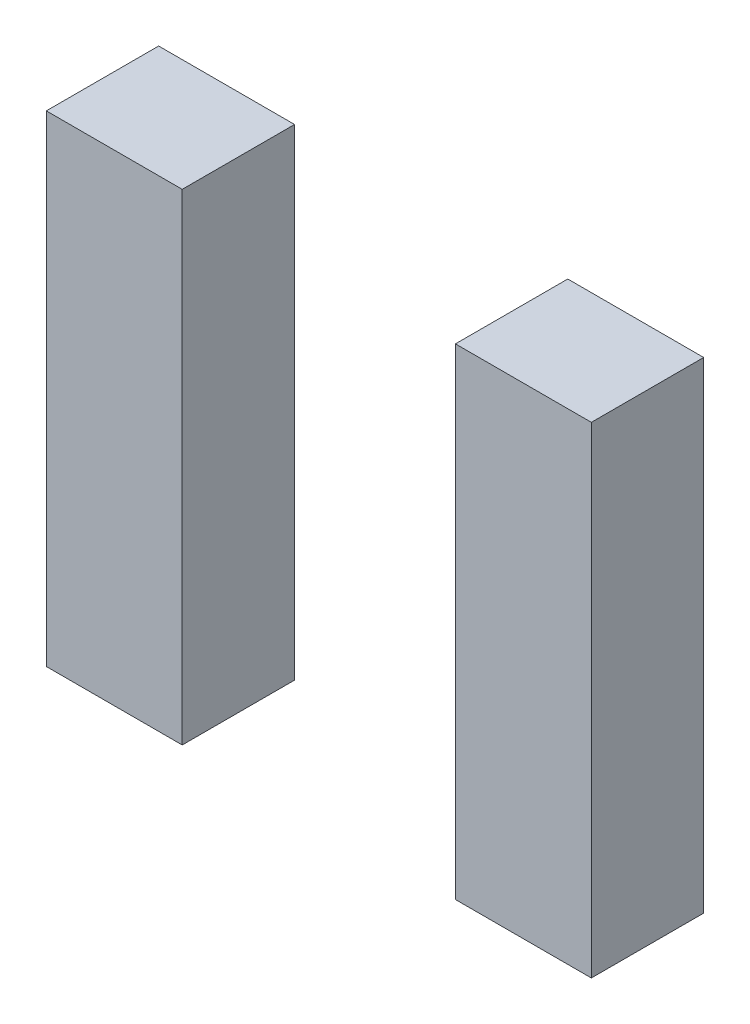
ISO-10303-21;
HEADER;
FILE_DESCRIPTION(('STEP AP214'),'2;1');
FILE_NAME('part.step','',(''),(''),'','','');
FILE_SCHEMA(('AUTOMOTIVE_DESIGN { 1 0 10303 214 1 1 1 1 }'));
ENDSEC;
DATA;
#1=APPLICATION_CONTEXT('core data for automotive mechanical design processes');
#2=APPLICATION_PROTOCOL_DEFINITION('international standard','automotive_design',2000,#1);
#3=PRODUCT_CONTEXT('',#1,'mechanical');
#4=PRODUCT('Part','Part','',(#3));
#5=PRODUCT_RELATED_PRODUCT_CATEGORY('part','',(#4));
#6=PRODUCT_DEFINITION_FORMATION('','',#4);
#7=PRODUCT_DEFINITION_CONTEXT('part definition',#1,'design');
#8=PRODUCT_DEFINITION('design','',#6,#7);
#9=PRODUCT_DEFINITION_SHAPE('','',#8);
#10=(LENGTH_UNIT() NAMED_UNIT(*) SI_UNIT(.MILLI.,.METRE.));
#11=(NAMED_UNIT(*) PLANE_ANGLE_UNIT() SI_UNIT($,.RADIAN.));
#12=(NAMED_UNIT(*) SI_UNIT($,.STERADIAN.) SOLID_ANGLE_UNIT());
#13=UNCERTAINTY_MEASURE_WITH_UNIT(LENGTH_MEASURE(1.E-05),#10,'distance_accuracy_value','');
#14=(GEOMETRIC_REPRESENTATION_CONTEXT(3) GLOBAL_UNCERTAINTY_ASSIGNED_CONTEXT((#13)) GLOBAL_UNIT_ASSIGNED_CONTEXT((#10,
#11,#12)) REPRESENTATION_CONTEXT('',''));
#15=CARTESIAN_POINT('',(0.,0.,0.));
#16=DIRECTION('',(0.,0.,1.));
#17=DIRECTION('',(1.,0.,0.));
#18=AXIS2_PLACEMENT_3D('',#15,#16,#17);
#19=CARTESIAN_POINT('',(-32.7279,44.069,20.574));
#20=DIRECTION('',(1.,0.,0.));
#21=DIRECTION('',(0.,1.,0.));
#22=AXIS2_PLACEMENT_3D('',#19,#20,#21);
#23=PLANE('',#22);
#24=DIRECTION('',(0.,-1.,0.));
#25=VECTOR('',#24,1.);
#26=CARTESIAN_POINT('',(-32.7279,44.069,0.));
#27=LINE('',#26,#25);
#28=CARTESIAN_POINT('',(-32.7279,44.069,0.));
#29=VERTEX_POINT('',#28);
#30=CARTESIAN_POINT('',(-32.7279,-44.069,0.));
#31=VERTEX_POINT('',#30);
#32=EDGE_CURVE('E114',#29,#31,#27,.T.);
#33=ORIENTED_EDGE('',*,*,#32,.T.);
#34=DIRECTION('',(0.,0.,-1.));
#35=VECTOR('',#34,1.);
#36=CARTESIAN_POINT('',(-32.7279,-44.069,20.574));
#37=LINE('',#36,#35);
#38=CARTESIAN_POINT('',(-32.7279,-44.069,20.574));
#39=VERTEX_POINT('',#38);
#40=EDGE_CURVE('E12',#39,#31,#37,.T.);
#41=ORIENTED_EDGE('',*,*,#40,.F.);
#42=DIRECTION('',(0.,-1.,0.));
#43=VECTOR('',#42,1.);
#44=CARTESIAN_POINT('',(-32.7279,44.069,20.574));
#45=LINE('',#44,#43);
#46=CARTESIAN_POINT('',(-32.7279,44.069,20.574));
#47=VERTEX_POINT('',#46);
#48=EDGE_CURVE('E102',#47,#39,#45,.T.);
#49=ORIENTED_EDGE('',*,*,#48,.F.);
#50=DIRECTION('',(0.,0.,-1.));
#51=VECTOR('',#50,1.);
#52=CARTESIAN_POINT('',(-32.7279,44.069,20.574));
#53=LINE('',#52,#51);
#54=EDGE_CURVE('E110',#47,#29,#53,.T.);
#55=ORIENTED_EDGE('',*,*,#54,.T.);
#56=EDGE_LOOP('',(#33,#41,#49,#55));
#57=FACE_BOUND('',#56,.T.);
#58=ADVANCED_FACE('F51',(#57),#23,.F.);
#59=CARTESIAN_POINT('',(-32.7279,-44.069,20.574));
#60=DIRECTION('',(0.,1.,0.));
#61=DIRECTION('',(0.,0.,1.));
#62=AXIS2_PLACEMENT_3D('',#59,#60,#61);
#63=PLANE('',#62);
#64=DIRECTION('',(1.,0.,0.));
#65=VECTOR('',#64,1.);
#66=CARTESIAN_POINT('',(-32.7279,-44.069,0.));
#67=LINE('',#66,#65);
#68=CARTESIAN_POINT('',(-7.83590000000002,-44.069,0.));
#69=VERTEX_POINT('',#68);
#70=EDGE_CURVE('E106',#31,#69,#67,.T.);
#71=ORIENTED_EDGE('',*,*,#70,.T.);
#72=DIRECTION('',(0.,0.,-1.));
#73=VECTOR('',#72,1.);
#74=CARTESIAN_POINT('',(-7.83590000000002,-44.069,20.574));
#75=LINE('',#74,#73);
#76=CARTESIAN_POINT('',(-7.83590000000002,-44.069,20.574));
#77=VERTEX_POINT('',#76);
#78=EDGE_CURVE('E59',#77,#69,#75,.T.);
#79=ORIENTED_EDGE('',*,*,#78,.F.);
#80=DIRECTION('',(1.,0.,0.));
#81=VECTOR('',#80,1.);
#82=CARTESIAN_POINT('',(-32.7279,-44.069,20.574));
#83=LINE('',#82,#81);
#84=EDGE_CURVE('E97',#39,#77,#83,.T.);
#85=ORIENTED_EDGE('',*,*,#84,.F.);
#86=ORIENTED_EDGE('',*,*,#40,.T.);
#87=EDGE_LOOP('',(#71,#79,#85,#86));
#88=FACE_BOUND('',#87,.T.);
#89=ADVANCED_FACE('F105',(#88),#63,.F.);
#90=CARTESIAN_POINT('',(-7.83590000000003,44.069,20.574));
#91=DIRECTION('',(-1.,0.,0.));
#92=DIRECTION('',(0.,-1.,0.));
#93=AXIS2_PLACEMENT_3D('',#90,#91,#92);
#94=PLANE('',#93);
#95=DIRECTION('',(0.,1.,0.));
#96=VECTOR('',#95,1.);
#97=CARTESIAN_POINT('',(-7.83590000000003,44.069,0.));
#98=LINE('',#97,#96);
#99=CARTESIAN_POINT('',(-7.83590000000003,44.069,0.));
#100=VERTEX_POINT('',#99);
#101=EDGE_CURVE('E84',#69,#100,#98,.T.);
#102=ORIENTED_EDGE('',*,*,#101,.T.);
#103=DIRECTION('',(0.,0.,-1.));
#104=VECTOR('',#103,1.);
#105=CARTESIAN_POINT('',(-7.83590000000003,44.069,20.574));
#106=LINE('',#105,#104);
#107=CARTESIAN_POINT('',(-7.83590000000003,44.069,20.574));
#108=VERTEX_POINT('',#107);
#109=EDGE_CURVE('E107',#108,#100,#106,.T.);
#110=ORIENTED_EDGE('',*,*,#109,.F.);
#111=DIRECTION('',(0.,1.,0.));
#112=VECTOR('',#111,1.);
#113=CARTESIAN_POINT('',(-7.83590000000003,44.069,20.574));
#114=LINE('',#113,#112);
#115=EDGE_CURVE('E100',#77,#108,#114,.T.);
#116=ORIENTED_EDGE('',*,*,#115,.F.);
#117=ORIENTED_EDGE('',*,*,#78,.T.);
#118=EDGE_LOOP('',(#102,#110,#116,#117));
#119=FACE_BOUND('',#118,.T.);
#120=ADVANCED_FACE('F108',(#119),#94,.F.);
#121=CARTESIAN_POINT('',(-32.7279,44.069,20.574));
#122=DIRECTION('',(0.,-1.,0.));
#123=DIRECTION('',(0.,0.,-1.));
#124=AXIS2_PLACEMENT_3D('',#121,#122,#123);
#125=PLANE('',#124);
#126=DIRECTION('',(-1.,0.,0.));
#127=VECTOR('',#126,1.);
#128=CARTESIAN_POINT('',(-32.7279,44.069,0.));
#129=LINE('',#128,#127);
#130=EDGE_CURVE('E90',#100,#29,#129,.T.);
#131=ORIENTED_EDGE('',*,*,#130,.T.);
#132=ORIENTED_EDGE('',*,*,#54,.F.);
#133=DIRECTION('',(-1.,0.,0.));
#134=VECTOR('',#133,1.);
#135=CARTESIAN_POINT('',(-32.7279,44.069,20.574));
#136=LINE('',#135,#134);
#137=EDGE_CURVE('E67',#108,#47,#136,.T.);
#138=ORIENTED_EDGE('',*,*,#137,.F.);
#139=ORIENTED_EDGE('',*,*,#109,.T.);
#140=EDGE_LOOP('',(#131,#132,#138,#139));
#141=FACE_BOUND('',#140,.T.);
#142=ADVANCED_FACE('F121',(#141),#125,.F.);
#143=CARTESIAN_POINT('',(0.,0.,20.574));
#144=DIRECTION('',(0.,0.,1.));
#145=DIRECTION('',(1.,0.,0.));
#146=AXIS2_PLACEMENT_3D('',#143,#144,#145);
#147=PLANE('',#146);
#148=ORIENTED_EDGE('',*,*,#48,.T.);
#149=ORIENTED_EDGE('',*,*,#84,.T.);
#150=ORIENTED_EDGE('',*,*,#115,.T.);
#151=ORIENTED_EDGE('',*,*,#137,.T.);
#152=EDGE_LOOP('',(#148,#149,#150,#151));
#153=FACE_BOUND('',#152,.T.);
#154=ADVANCED_FACE('F98',(#153),#147,.T.);
#155=CARTESIAN_POINT('',(0.,0.,0.));
#156=DIRECTION('',(0.,0.,1.));
#157=DIRECTION('',(1.,0.,0.));
#158=AXIS2_PLACEMENT_3D('',#155,#156,#157);
#159=PLANE('',#158);
#160=ORIENTED_EDGE('',*,*,#32,.F.);
#161=ORIENTED_EDGE('',*,*,#130,.F.);
#162=ORIENTED_EDGE('',*,*,#101,.F.);
#163=ORIENTED_EDGE('',*,*,#70,.F.);
#164=EDGE_LOOP('',(#160,#161,#162,#163));
#165=FACE_BOUND('',#164,.T.);
#166=ADVANCED_FACE('F124',(#165),#159,.F.);
#167=CLOSED_SHELL('',(#58,#89,#120,#142,#154,#166));
#168=MANIFOLD_SOLID_BREP('B2',#167);
#169=CARTESIAN_POINT('',(-107.6579,43.561,20.574));
#170=DIRECTION('',(1.,0.,0.));
#171=DIRECTION('',(0.,0.,-1.));
#172=AXIS2_PLACEMENT_3D('',#169,#170,#171);
#173=PLANE('',#172);
#174=DIRECTION('',(0.,-1.,0.));
#175=VECTOR('',#174,1.);
#176=CARTESIAN_POINT('',(-107.6579,43.561,0.));
#177=LINE('',#176,#175);
#178=CARTESIAN_POINT('',(-107.6579,43.561,0.));
#179=VERTEX_POINT('',#178);
#180=CARTESIAN_POINT('',(-107.6579,-44.577,0.));
#181=VERTEX_POINT('',#180);
#182=EDGE_CURVE('E243',#179,#181,#177,.T.);
#183=ORIENTED_EDGE('',*,*,#182,.T.);
#184=DIRECTION('',(0.,0.,-1.));
#185=VECTOR('',#184,1.);
#186=CARTESIAN_POINT('',(-107.6579,-44.577,20.574));
#187=LINE('',#186,#185);
#188=CARTESIAN_POINT('',(-107.6579,-44.577,20.574));
#189=VERTEX_POINT('',#188);
#190=EDGE_CURVE('E49',#189,#181,#187,.T.);
#191=ORIENTED_EDGE('',*,*,#190,.F.);
#192=DIRECTION('',(0.,-1.,0.));
#193=VECTOR('',#192,1.);
#194=CARTESIAN_POINT('',(-107.6579,43.561,20.574));
#195=LINE('',#194,#193);
#196=CARTESIAN_POINT('',(-107.6579,43.561,20.574));
#197=VERTEX_POINT('',#196);
#198=EDGE_CURVE('E227',#197,#189,#195,.T.);
#199=ORIENTED_EDGE('',*,*,#198,.F.);
#200=DIRECTION('',(0.,0.,-1.));
#201=VECTOR('',#200,1.);
#202=CARTESIAN_POINT('',(-107.6579,43.561,20.574));
#203=LINE('',#202,#201);
#204=EDGE_CURVE('E239',#197,#179,#203,.T.);
#205=ORIENTED_EDGE('',*,*,#204,.T.);
#206=EDGE_LOOP('',(#183,#191,#199,#205));
#207=FACE_BOUND('',#206,.T.);
#208=ADVANCED_FACE('F175',(#207),#173,.F.);
#209=CARTESIAN_POINT('',(-107.6579,-44.577,20.574));
#210=DIRECTION('',(0.,1.,0.));
#211=DIRECTION('',(0.,0.,1.));
#212=AXIS2_PLACEMENT_3D('',#209,#210,#211);
#213=PLANE('',#212);
#214=DIRECTION('',(1.,0.,0.));
#215=VECTOR('',#214,1.);
#216=CARTESIAN_POINT('',(-107.6579,-44.577,0.));
#217=LINE('',#216,#215);
#218=CARTESIAN_POINT('',(-82.7659,-44.577,0.));
#219=VERTEX_POINT('',#218);
#220=EDGE_CURVE('E232',#181,#219,#217,.T.);
#221=ORIENTED_EDGE('',*,*,#220,.T.);
#222=DIRECTION('',(0.,0.,-1.));
#223=VECTOR('',#222,1.);
#224=CARTESIAN_POINT('',(-82.7659,-44.577,20.574));
#225=LINE('',#224,#223);
#226=CARTESIAN_POINT('',(-82.7659,-44.577,20.574));
#227=VERTEX_POINT('',#226);
#228=EDGE_CURVE('E184',#227,#219,#225,.T.);
#229=ORIENTED_EDGE('',*,*,#228,.F.);
#230=DIRECTION('',(1.,0.,0.));
#231=VECTOR('',#230,1.);
#232=CARTESIAN_POINT('',(-107.6579,-44.577,20.574));
#233=LINE('',#232,#231);
#234=EDGE_CURVE('E222',#189,#227,#233,.T.);
#235=ORIENTED_EDGE('',*,*,#234,.F.);
#236=ORIENTED_EDGE('',*,*,#190,.T.);
#237=EDGE_LOOP('',(#221,#229,#235,#236));
#238=FACE_BOUND('',#237,.T.);
#239=ADVANCED_FACE('F231',(#238),#213,.F.);
#240=CARTESIAN_POINT('',(-82.7659,43.561,20.574));
#241=DIRECTION('',(-1.,0.,0.));
#242=DIRECTION('',(0.,-1.,0.));
#243=AXIS2_PLACEMENT_3D('',#240,#241,#242);
#244=PLANE('',#243);
#245=DIRECTION('',(0.,1.,0.));
#246=VECTOR('',#245,1.);
#247=CARTESIAN_POINT('',(-82.7659,43.561,0.));
#248=LINE('',#247,#246);
#249=CARTESIAN_POINT('',(-82.7659,43.561,0.));
#250=VERTEX_POINT('',#249);
#251=EDGE_CURVE('E209',#219,#250,#248,.T.);
#252=ORIENTED_EDGE('',*,*,#251,.T.);
#253=DIRECTION('',(0.,0.,-1.));
#254=VECTOR('',#253,1.);
#255=CARTESIAN_POINT('',(-82.7659,43.561,20.574));
#256=LINE('',#255,#254);
#257=CARTESIAN_POINT('',(-82.7659,43.561,20.574));
#258=VERTEX_POINT('',#257);
#259=EDGE_CURVE('E234',#258,#250,#256,.T.);
#260=ORIENTED_EDGE('',*,*,#259,.F.);
#261=DIRECTION('',(0.,1.,0.));
#262=VECTOR('',#261,1.);
#263=CARTESIAN_POINT('',(-82.7659,43.561,20.574));
#264=LINE('',#263,#262);
#265=EDGE_CURVE('E225',#227,#258,#264,.T.);
#266=ORIENTED_EDGE('',*,*,#265,.F.);
#267=ORIENTED_EDGE('',*,*,#228,.T.);
#268=EDGE_LOOP('',(#252,#260,#266,#267));
#269=FACE_BOUND('',#268,.T.);
#270=ADVANCED_FACE('F235',(#269),#244,.F.);
#271=CARTESIAN_POINT('',(-107.6579,43.561,20.574));
#272=DIRECTION('',(0.,-1.,0.));
#273=DIRECTION('',(0.,0.,-1.));
#274=AXIS2_PLACEMENT_3D('',#271,#272,#273);
#275=PLANE('',#274);
#276=DIRECTION('',(-1.,0.,0.));
#277=VECTOR('',#276,1.);
#278=CARTESIAN_POINT('',(-107.6579,43.561,0.));
#279=LINE('',#278,#277);
#280=EDGE_CURVE('E215',#250,#179,#279,.T.);
#281=ORIENTED_EDGE('',*,*,#280,.T.);
#282=ORIENTED_EDGE('',*,*,#204,.F.);
#283=DIRECTION('',(-1.,0.,0.));
#284=VECTOR('',#283,1.);
#285=CARTESIAN_POINT('',(-107.6579,43.561,20.574));
#286=LINE('',#285,#284);
#287=EDGE_CURVE('E192',#258,#197,#286,.T.);
#288=ORIENTED_EDGE('',*,*,#287,.F.);
#289=ORIENTED_EDGE('',*,*,#259,.T.);
#290=EDGE_LOOP('',(#281,#282,#288,#289));
#291=FACE_BOUND('',#290,.T.);
#292=ADVANCED_FACE('F256',(#291),#275,.F.);
#293=CARTESIAN_POINT('',(0.,0.,20.574));
#294=DIRECTION('',(0.,0.,1.));
#295=DIRECTION('',(1.,0.,0.));
#296=AXIS2_PLACEMENT_3D('',#293,#294,#295);
#297=PLANE('',#296);
#298=ORIENTED_EDGE('',*,*,#198,.T.);
#299=ORIENTED_EDGE('',*,*,#234,.T.);
#300=ORIENTED_EDGE('',*,*,#265,.T.);
#301=ORIENTED_EDGE('',*,*,#287,.T.);
#302=EDGE_LOOP('',(#298,#299,#300,#301));
#303=FACE_BOUND('',#302,.T.);
#304=ADVANCED_FACE('F223',(#303),#297,.T.);
#305=CARTESIAN_POINT('',(0.,0.,0.));
#306=DIRECTION('',(0.,0.,1.));
#307=DIRECTION('',(1.,0.,0.));
#308=AXIS2_PLACEMENT_3D('',#305,#306,#307);
#309=PLANE('',#308);
#310=ORIENTED_EDGE('',*,*,#182,.F.);
#311=ORIENTED_EDGE('',*,*,#280,.F.);
#312=ORIENTED_EDGE('',*,*,#251,.F.);
#313=ORIENTED_EDGE('',*,*,#220,.F.);
#314=EDGE_LOOP('',(#310,#311,#312,#313));
#315=FACE_BOUND('',#314,.T.);
#316=ADVANCED_FACE('F259',(#315),#309,.F.);
#317=CLOSED_SHELL('',(#208,#239,#270,#292,#304,#316));
#318=MANIFOLD_SOLID_BREP('B6',#317);
#319=ADVANCED_BREP_SHAPE_REPRESENTATION('',(#18,#168,#318),#14);
#320=SHAPE_DEFINITION_REPRESENTATION(#9,#319);
ENDSEC;
END-ISO-10303-21;
